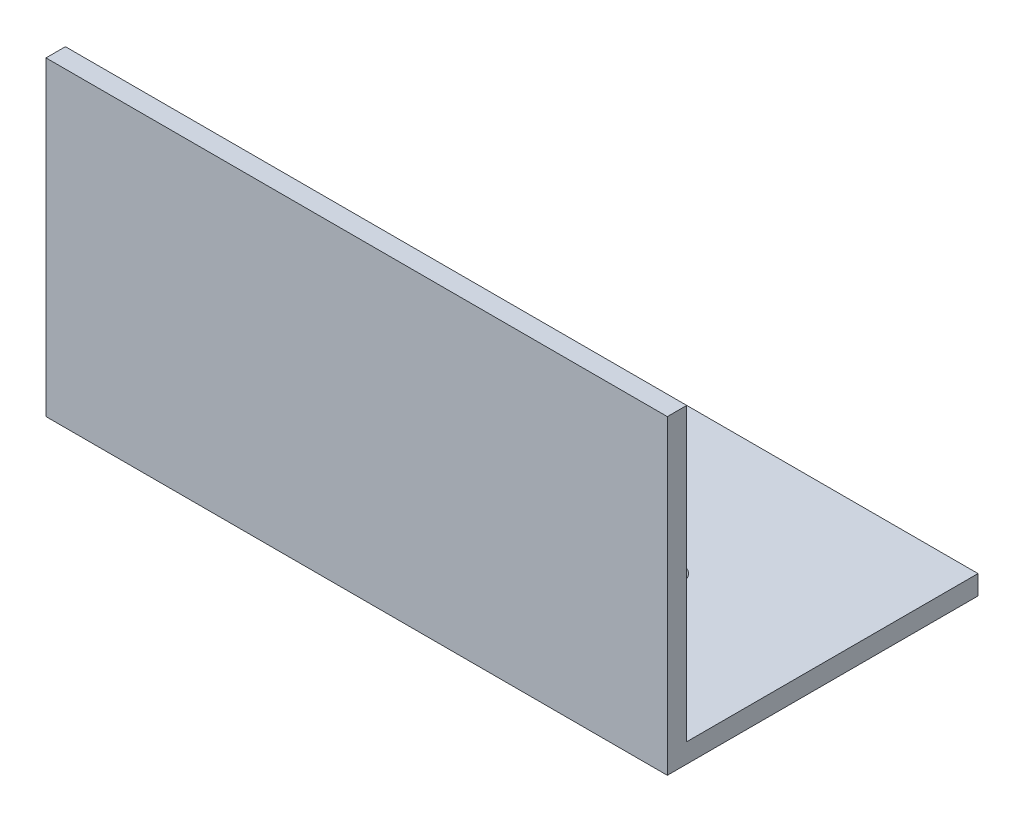
ISO-10303-21;
HEADER;
FILE_DESCRIPTION(('STEP AP214'),'2;1');
FILE_NAME('part.step','',(''),(''),'','','');
FILE_SCHEMA(('AUTOMOTIVE_DESIGN { 1 0 10303 214 1 1 1 1 }'));
ENDSEC;
DATA;
#1=APPLICATION_CONTEXT('core data for automotive mechanical design processes');
#2=APPLICATION_PROTOCOL_DEFINITION('international standard','automotive_design',2000,#1);
#3=PRODUCT_CONTEXT('',#1,'mechanical');
#4=PRODUCT('Part','Part','',(#3));
#5=PRODUCT_RELATED_PRODUCT_CATEGORY('part','',(#4));
#6=PRODUCT_DEFINITION_FORMATION('','',#4);
#7=PRODUCT_DEFINITION_CONTEXT('part definition',#1,'design');
#8=PRODUCT_DEFINITION('design','',#6,#7);
#9=PRODUCT_DEFINITION_SHAPE('','',#8);
#10=(LENGTH_UNIT() NAMED_UNIT(*) SI_UNIT(.MILLI.,.METRE.));
#11=(NAMED_UNIT(*) PLANE_ANGLE_UNIT() SI_UNIT($,.RADIAN.));
#12=(NAMED_UNIT(*) SI_UNIT($,.STERADIAN.) SOLID_ANGLE_UNIT());
#13=UNCERTAINTY_MEASURE_WITH_UNIT(LENGTH_MEASURE(1.E-05),#10,'distance_accuracy_value','');
#14=(GEOMETRIC_REPRESENTATION_CONTEXT(3) GLOBAL_UNCERTAINTY_ASSIGNED_CONTEXT((#13)) GLOBAL_UNIT_ASSIGNED_CONTEXT((#10,
#11,#12)) REPRESENTATION_CONTEXT('',''));
#15=CARTESIAN_POINT('',(0.,0.,0.));
#16=DIRECTION('',(0.,0.,1.));
#17=DIRECTION('',(1.,0.,0.));
#18=AXIS2_PLACEMENT_3D('',#15,#16,#17);
#19=CARTESIAN_POINT('',(101.6,0.,-50.8));
#20=DIRECTION('',(0.,1.,0.));
#21=DIRECTION('',(0.,0.,1.));
#22=AXIS2_PLACEMENT_3D('',#19,#20,#21);
#23=PLANE('',#22);
#24=CARTESIAN_POINT('',(76.2000000000001,-3.05264022208805E-13,-25.4));
#25=DIRECTION('',(0.,-1.,0.));
#26=DIRECTION('',(0.,0.,-1.));
#27=AXIS2_PLACEMENT_3D('',#24,#25,#26);
#28=CIRCLE('',#27,2.45744999999999);
#29=CARTESIAN_POINT('',(76.2000000000001,-3.05264022208805E-13,-27.85745));
#30=VERTEX_POINT('',#29);
#31=EDGE_CURVE('E162',#30,#30,#28,.T.);
#32=ORIENTED_EDGE('',*,*,#31,.F.);
#33=EDGE_LOOP('',(#32));
#34=FACE_BOUND('',#33,.T.);
#35=CARTESIAN_POINT('',(25.4000000000001,-1.02226435465356E-13,-25.4));
#36=DIRECTION('',(0.,-1.,0.));
#37=DIRECTION('',(0.,0.,-1.));
#38=AXIS2_PLACEMENT_3D('',#35,#36,#37);
#39=CIRCLE('',#38,2.45744999999999);
#40=CARTESIAN_POINT('',(25.4000000000001,-1.02226435465356E-13,-27.85745));
#41=VERTEX_POINT('',#40);
#42=EDGE_CURVE('E165',#41,#41,#39,.T.);
#43=ORIENTED_EDGE('',*,*,#42,.F.);
#44=EDGE_LOOP('',(#43));
#45=FACE_BOUND('',#44,.T.);
#46=DIRECTION('',(0.,0.,-1.));
#47=VECTOR('',#46,1.);
#48=CARTESIAN_POINT('',(0.,0.,-50.8));
#49=LINE('',#48,#47);
#50=CARTESIAN_POINT('',(0.,0.,0.));
#51=VERTEX_POINT('',#50);
#52=CARTESIAN_POINT('',(0.,0.,-50.8));
#53=VERTEX_POINT('',#52);
#54=EDGE_CURVE('E118',#51,#53,#49,.T.);
#55=ORIENTED_EDGE('',*,*,#54,.T.);
#56=DIRECTION('',(-1.,0.,0.));
#57=VECTOR('',#56,1.);
#58=CARTESIAN_POINT('',(101.6,0.,-50.8));
#59=LINE('',#58,#57);
#60=CARTESIAN_POINT('',(101.6,0.,-50.8));
#61=VERTEX_POINT('',#60);
#62=EDGE_CURVE('E11',#61,#53,#59,.T.);
#63=ORIENTED_EDGE('',*,*,#62,.F.);
#64=DIRECTION('',(0.,0.,-1.));
#65=VECTOR('',#64,1.);
#66=CARTESIAN_POINT('',(101.6,0.,-50.8));
#67=LINE('',#66,#65);
#68=CARTESIAN_POINT('',(101.6,0.,0.));
#69=VERTEX_POINT('',#68);
#70=EDGE_CURVE('E129',#69,#61,#67,.T.);
#71=ORIENTED_EDGE('',*,*,#70,.F.);
#72=DIRECTION('',(-1.,0.,0.));
#73=VECTOR('',#72,1.);
#74=CARTESIAN_POINT('',(101.6,0.,0.));
#75=LINE('',#74,#73);
#76=EDGE_CURVE('E114',#69,#51,#75,.T.);
#77=ORIENTED_EDGE('',*,*,#76,.T.);
#78=EDGE_LOOP('',(#55,#63,#71,#77));
#79=FACE_BOUND('',#78,.T.);
#80=ADVANCED_FACE('F33',(#34,#45,#79),#23,.F.);
#81=CARTESIAN_POINT('',(101.6,3.175,-50.8));
#82=DIRECTION('',(0.,0.,1.));
#83=DIRECTION('',(1.,0.,0.));
#84=AXIS2_PLACEMENT_3D('',#81,#82,#83);
#85=PLANE('',#84);
#86=DIRECTION('',(0.,1.,0.));
#87=VECTOR('',#86,1.);
#88=CARTESIAN_POINT('',(0.,3.175,-50.8));
#89=LINE('',#88,#87);
#90=CARTESIAN_POINT('',(0.,3.175,-50.8));
#91=VERTEX_POINT('',#90);
#92=EDGE_CURVE('E121',#53,#91,#89,.T.);
#93=ORIENTED_EDGE('',*,*,#92,.T.);
#94=DIRECTION('',(-1.,0.,0.));
#95=VECTOR('',#94,1.);
#96=CARTESIAN_POINT('',(101.6,3.175,-50.8));
#97=LINE('',#96,#95);
#98=CARTESIAN_POINT('',(101.6,3.175,-50.8));
#99=VERTEX_POINT('',#98);
#100=EDGE_CURVE('E42',#99,#91,#97,.T.);
#101=ORIENTED_EDGE('',*,*,#100,.F.);
#102=DIRECTION('',(0.,1.,0.));
#103=VECTOR('',#102,1.);
#104=CARTESIAN_POINT('',(101.6,3.175,-50.8));
#105=LINE('',#104,#103);
#106=EDGE_CURVE('E87',#61,#99,#105,.T.);
#107=ORIENTED_EDGE('',*,*,#106,.F.);
#108=ORIENTED_EDGE('',*,*,#62,.T.);
#109=EDGE_LOOP('',(#93,#101,#107,#108));
#110=FACE_BOUND('',#109,.T.);
#111=ADVANCED_FACE('F154',(#110),#85,.F.);
#112=CARTESIAN_POINT('',(101.6,3.175,-3.17500000000001));
#113=DIRECTION('',(0.,-1.,0.));
#114=DIRECTION('',(0.,0.,-1.));
#115=AXIS2_PLACEMENT_3D('',#112,#113,#114);
#116=PLANE('',#115);
#117=CARTESIAN_POINT('',(76.2000000000001,3.175,-25.4));
#118=DIRECTION('',(0.,-1.,0.));
#119=DIRECTION('',(0.,0.,-1.));
#120=AXIS2_PLACEMENT_3D('',#117,#118,#119);
#121=CIRCLE('',#120,2.45744999999999);
#122=CARTESIAN_POINT('',(76.2000000000001,3.175,-27.85745));
#123=VERTEX_POINT('',#122);
#124=EDGE_CURVE('E36',#123,#123,#121,.T.);
#125=ORIENTED_EDGE('',*,*,#124,.T.);
#126=EDGE_LOOP('',(#125));
#127=FACE_BOUND('',#126,.T.);
#128=CARTESIAN_POINT('',(25.4000000000001,3.175,-25.4));
#129=DIRECTION('',(0.,-1.,0.));
#130=DIRECTION('',(0.,0.,-1.));
#131=AXIS2_PLACEMENT_3D('',#128,#129,#130);
#132=CIRCLE('',#131,2.45744999999999);
#133=CARTESIAN_POINT('',(25.4000000000001,3.175,-27.85745));
#134=VERTEX_POINT('',#133);
#135=EDGE_CURVE('E122',#134,#134,#132,.T.);
#136=ORIENTED_EDGE('',*,*,#135,.T.);
#137=EDGE_LOOP('',(#136));
#138=FACE_BOUND('',#137,.T.);
#139=DIRECTION('',(0.,0.,1.));
#140=VECTOR('',#139,1.);
#141=CARTESIAN_POINT('',(0.,3.175,-3.17500000000001));
#142=LINE('',#141,#140);
#143=CARTESIAN_POINT('',(0.,3.175,-3.17500000000001));
#144=VERTEX_POINT('',#143);
#145=EDGE_CURVE('E124',#91,#144,#142,.T.);
#146=ORIENTED_EDGE('',*,*,#145,.T.);
#147=DIRECTION('',(-1.,0.,0.));
#148=VECTOR('',#147,1.);
#149=CARTESIAN_POINT('',(101.6,3.175,-3.17500000000001));
#150=LINE('',#149,#148);
#151=CARTESIAN_POINT('',(101.6,3.175,-3.17500000000001));
#152=VERTEX_POINT('',#151);
#153=EDGE_CURVE('E109',#152,#144,#150,.T.);
#154=ORIENTED_EDGE('',*,*,#153,.F.);
#155=DIRECTION('',(0.,0.,1.));
#156=VECTOR('',#155,1.);
#157=CARTESIAN_POINT('',(101.6,3.175,-3.17500000000001));
#158=LINE('',#157,#156);
#159=EDGE_CURVE('E100',#99,#152,#158,.T.);
#160=ORIENTED_EDGE('',*,*,#159,.F.);
#161=ORIENTED_EDGE('',*,*,#100,.T.);
#162=EDGE_LOOP('',(#146,#154,#160,#161));
#163=FACE_BOUND('',#162,.T.);
#164=ADVANCED_FACE('F136',(#127,#138,#163),#116,.F.);
#165=CARTESIAN_POINT('',(101.6,50.8,-3.175));
#166=DIRECTION('',(0.,0.,1.));
#167=DIRECTION('',(0.,-1.,0.));
#168=AXIS2_PLACEMENT_3D('',#165,#166,#167);
#169=PLANE('',#168);
#170=DIRECTION('',(0.,1.,0.));
#171=VECTOR('',#170,1.);
#172=CARTESIAN_POINT('',(0.,50.8,-3.175));
#173=LINE('',#172,#171);
#174=CARTESIAN_POINT('',(0.,50.8,-3.175));
#175=VERTEX_POINT('',#174);
#176=EDGE_CURVE('E108',#144,#175,#173,.T.);
#177=ORIENTED_EDGE('',*,*,#176,.T.);
#178=DIRECTION('',(-1.,0.,0.));
#179=VECTOR('',#178,1.);
#180=CARTESIAN_POINT('',(101.6,50.8,-3.175));
#181=LINE('',#180,#179);
#182=CARTESIAN_POINT('',(101.6,50.8,-3.175));
#183=VERTEX_POINT('',#182);
#184=EDGE_CURVE('E105',#183,#175,#181,.T.);
#185=ORIENTED_EDGE('',*,*,#184,.F.);
#186=DIRECTION('',(0.,1.,0.));
#187=VECTOR('',#186,1.);
#188=CARTESIAN_POINT('',(101.6,50.8,-3.175));
#189=LINE('',#188,#187);
#190=EDGE_CURVE('E94',#152,#183,#189,.T.);
#191=ORIENTED_EDGE('',*,*,#190,.F.);
#192=ORIENTED_EDGE('',*,*,#153,.T.);
#193=EDGE_LOOP('',(#177,#185,#191,#192));
#194=FACE_BOUND('',#193,.T.);
#195=ADVANCED_FACE('F106',(#194),#169,.F.);
#196=CARTESIAN_POINT('',(101.6,50.8,0.));
#197=DIRECTION('',(0.,-1.,0.));
#198=DIRECTION('',(0.,0.,-1.));
#199=AXIS2_PLACEMENT_3D('',#196,#197,#198);
#200=PLANE('',#199);
#201=DIRECTION('',(0.,0.,1.));
#202=VECTOR('',#201,1.);
#203=CARTESIAN_POINT('',(0.,50.8,0.));
#204=LINE('',#203,#202);
#205=CARTESIAN_POINT('',(0.,50.8,0.));
#206=VERTEX_POINT('',#205);
#207=EDGE_CURVE('E73',#175,#206,#204,.T.);
#208=ORIENTED_EDGE('',*,*,#207,.T.);
#209=DIRECTION('',(-1.,0.,0.));
#210=VECTOR('',#209,1.);
#211=CARTESIAN_POINT('',(101.6,50.8,0.));
#212=LINE('',#211,#210);
#213=CARTESIAN_POINT('',(101.6,50.8,0.));
#214=VERTEX_POINT('',#213);
#215=EDGE_CURVE('E110',#214,#206,#212,.T.);
#216=ORIENTED_EDGE('',*,*,#215,.F.);
#217=DIRECTION('',(0.,0.,1.));
#218=VECTOR('',#217,1.);
#219=CARTESIAN_POINT('',(101.6,50.8,0.));
#220=LINE('',#219,#218);
#221=EDGE_CURVE('E98',#183,#214,#220,.T.);
#222=ORIENTED_EDGE('',*,*,#221,.F.);
#223=ORIENTED_EDGE('',*,*,#184,.T.);
#224=EDGE_LOOP('',(#208,#216,#222,#223));
#225=FACE_BOUND('',#224,.T.);
#226=ADVANCED_FACE('F112',(#225),#200,.F.);
#227=CARTESIAN_POINT('',(101.6,0.,0.));
#228=DIRECTION('',(0.,0.,-1.));
#229=DIRECTION('',(-1.,0.,0.));
#230=AXIS2_PLACEMENT_3D('',#227,#228,#229);
#231=PLANE('',#230);
#232=DIRECTION('',(0.,-1.,0.));
#233=VECTOR('',#232,1.);
#234=CARTESIAN_POINT('',(0.,0.,0.));
#235=LINE('',#234,#233);
#236=EDGE_CURVE('E79',#206,#51,#235,.T.);
#237=ORIENTED_EDGE('',*,*,#236,.T.);
#238=ORIENTED_EDGE('',*,*,#76,.F.);
#239=DIRECTION('',(0.,-1.,0.));
#240=VECTOR('',#239,1.);
#241=CARTESIAN_POINT('',(101.6,0.,0.));
#242=LINE('',#241,#240);
#243=EDGE_CURVE('E50',#214,#69,#242,.T.);
#244=ORIENTED_EDGE('',*,*,#243,.F.);
#245=ORIENTED_EDGE('',*,*,#215,.T.);
#246=EDGE_LOOP('',(#237,#238,#244,#245));
#247=FACE_BOUND('',#246,.T.);
#248=ADVANCED_FACE('F143',(#247),#231,.F.);
#249=CARTESIAN_POINT('',(101.6,0.,0.));
#250=DIRECTION('',(-1.,0.,0.));
#251=DIRECTION('',(0.,0.,1.));
#252=AXIS2_PLACEMENT_3D('',#249,#250,#251);
#253=PLANE('',#252);
#254=ORIENTED_EDGE('',*,*,#70,.T.);
#255=ORIENTED_EDGE('',*,*,#106,.T.);
#256=ORIENTED_EDGE('',*,*,#159,.T.);
#257=ORIENTED_EDGE('',*,*,#190,.T.);
#258=ORIENTED_EDGE('',*,*,#221,.T.);
#259=ORIENTED_EDGE('',*,*,#243,.T.);
#260=EDGE_LOOP('',(#254,#255,#256,#257,#258,#259));
#261=FACE_BOUND('',#260,.T.);
#262=ADVANCED_FACE('F96',(#261),#253,.F.);
#263=CARTESIAN_POINT('',(0.,0.,0.));
#264=DIRECTION('',(-1.,0.,0.));
#265=DIRECTION('',(0.,0.,1.));
#266=AXIS2_PLACEMENT_3D('',#263,#264,#265);
#267=PLANE('',#266);
#268=ORIENTED_EDGE('',*,*,#54,.F.);
#269=ORIENTED_EDGE('',*,*,#236,.F.);
#270=ORIENTED_EDGE('',*,*,#207,.F.);
#271=ORIENTED_EDGE('',*,*,#176,.F.);
#272=ORIENTED_EDGE('',*,*,#145,.F.);
#273=ORIENTED_EDGE('',*,*,#92,.F.);
#274=EDGE_LOOP('',(#268,#269,#270,#271,#272,#273));
#275=FACE_BOUND('',#274,.T.);
#276=ADVANCED_FACE('F139',(#275),#267,.T.);
#277=CARTESIAN_POINT('',(25.4000000000001,-1.00972084858095E-13,-25.4));
#278=DIRECTION('',(0.,-1.,0.));
#279=DIRECTION('',(0.,0.,-1.));
#280=AXIS2_PLACEMENT_3D('',#277,#278,#279);
#281=CYLINDRICAL_SURFACE('',#280,2.45744999999999);
#282=ORIENTED_EDGE('',*,*,#42,.T.);
#283=EDGE_LOOP('',(#282));
#284=FACE_BOUND('',#283,.T.);
#285=ORIENTED_EDGE('',*,*,#135,.F.);
#286=EDGE_LOOP('',(#285));
#287=FACE_BOUND('',#286,.T.);
#288=ADVANCED_FACE('F178',(#284,#287),#281,.F.);
#289=CARTESIAN_POINT('',(76.2000000000001,-3.04009671601544E-13,-25.4));
#290=DIRECTION('',(0.,-1.,0.));
#291=DIRECTION('',(0.,0.,-1.));
#292=AXIS2_PLACEMENT_3D('',#289,#290,#291);
#293=CYLINDRICAL_SURFACE('',#292,2.45744999999999);
#294=ORIENTED_EDGE('',*,*,#31,.T.);
#295=EDGE_LOOP('',(#294));
#296=FACE_BOUND('',#295,.T.);
#297=ORIENTED_EDGE('',*,*,#124,.F.);
#298=EDGE_LOOP('',(#297));
#299=FACE_BOUND('',#298,.T.);
#300=ADVANCED_FACE('F175',(#296,#299),#293,.F.);
#301=CLOSED_SHELL('',(#80,#111,#164,#195,#226,#248,#262,#276,#288,#300));
#302=MANIFOLD_SOLID_BREP('B2',#301);
#303=ADVANCED_BREP_SHAPE_REPRESENTATION('',(#18,#302),#14);
#304=SHAPE_DEFINITION_REPRESENTATION(#9,#303);
ENDSEC;
END-ISO-10303-21;
